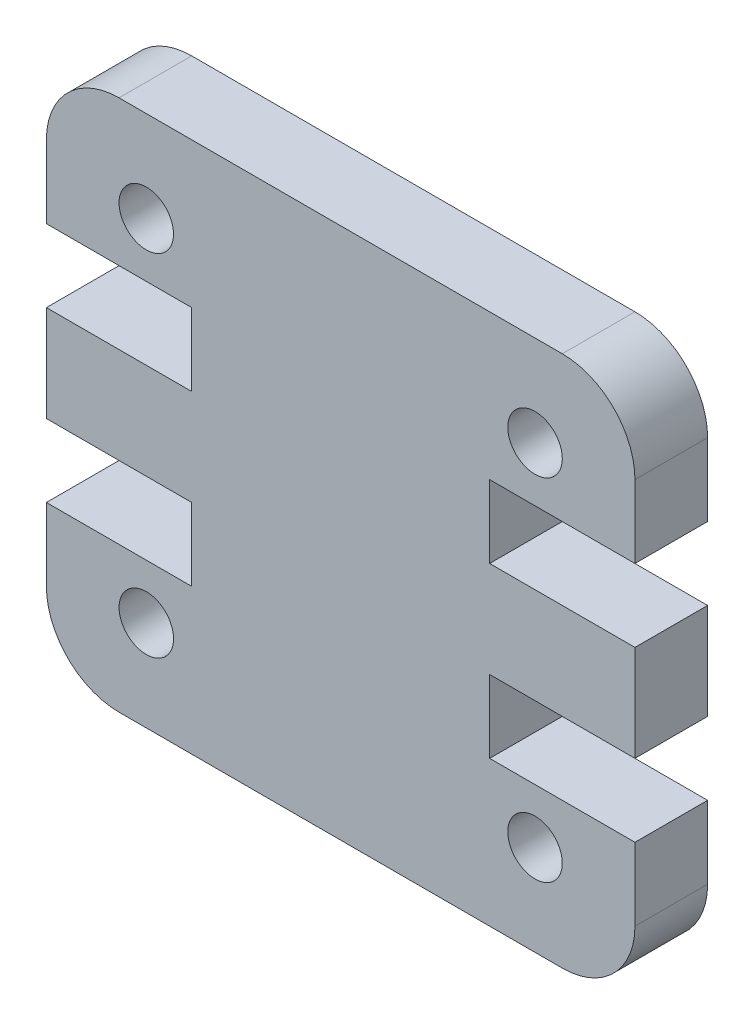
ISO-10303-21;
HEADER;
FILE_DESCRIPTION(('STEP AP214'),'2;1');
FILE_NAME('part.step','',(''),(''),'','','');
FILE_SCHEMA(('AUTOMOTIVE_DESIGN { 1 0 10303 214 1 1 1 1 }'));
ENDSEC;
DATA;
#1=APPLICATION_CONTEXT('core data for automotive mechanical design processes');
#2=APPLICATION_PROTOCOL_DEFINITION('international standard','automotive_design',2000,#1);
#3=PRODUCT_CONTEXT('',#1,'mechanical');
#4=PRODUCT('Part','Part','',(#3));
#5=PRODUCT_RELATED_PRODUCT_CATEGORY('part','',(#4));
#6=PRODUCT_DEFINITION_FORMATION('','',#4);
#7=PRODUCT_DEFINITION_CONTEXT('part definition',#1,'design');
#8=PRODUCT_DEFINITION('design','',#6,#7);
#9=PRODUCT_DEFINITION_SHAPE('','',#8);
#10=(LENGTH_UNIT() NAMED_UNIT(*) SI_UNIT(.MILLI.,.METRE.));
#11=(NAMED_UNIT(*) PLANE_ANGLE_UNIT() SI_UNIT($,.RADIAN.));
#12=(NAMED_UNIT(*) SI_UNIT($,.STERADIAN.) SOLID_ANGLE_UNIT());
#13=UNCERTAINTY_MEASURE_WITH_UNIT(LENGTH_MEASURE(1.E-05),#10,'distance_accuracy_value','');
#14=(GEOMETRIC_REPRESENTATION_CONTEXT(3) GLOBAL_UNCERTAINTY_ASSIGNED_CONTEXT((#13)) GLOBAL_UNIT_ASSIGNED_CONTEXT((#10,
#11,#12)) REPRESENTATION_CONTEXT('',''));
#15=CARTESIAN_POINT('',(0.,0.,0.));
#16=DIRECTION('',(0.,0.,1.));
#17=DIRECTION('',(1.,0.,0.));
#18=AXIS2_PLACEMENT_3D('',#15,#16,#17);
#19=CARTESIAN_POINT('',(14.2,2.,2.));
#20=DIRECTION('',(0.,0.,-1.));
#21=DIRECTION('',(-1.,0.,0.));
#22=AXIS2_PLACEMENT_3D('',#19,#20,#21);
#23=PLANE('',#22);
#24=CARTESIAN_POINT('',(13.4499999999986,12.1450000000001,2.));
#25=DIRECTION('',(0.,0.,1.));
#26=DIRECTION('',(1.,0.,0.));
#27=AXIS2_PLACEMENT_3D('',#24,#25,#26);
#28=CIRCLE('',#27,0.750000000000002);
#29=CARTESIAN_POINT('',(14.1999999999986,12.1450000000001,2.));
#30=VERTEX_POINT('',#29);
#31=EDGE_CURVE('E448',#30,#30,#28,.T.);
#32=ORIENTED_EDGE('',*,*,#31,.F.);
#33=EDGE_LOOP('',(#32));
#34=FACE_BOUND('',#33,.T.);
#35=CARTESIAN_POINT('',(13.4499999999986,2.4999999999999,2.));
#36=DIRECTION('',(0.,0.,1.));
#37=DIRECTION('',(-1.,0.,0.));
#38=AXIS2_PLACEMENT_3D('',#35,#36,#37);
#39=CIRCLE('',#38,0.750000000000002);
#40=CARTESIAN_POINT('',(12.6999999999986,2.4999999999999,2.));
#41=VERTEX_POINT('',#40);
#42=EDGE_CURVE('E230',#41,#41,#39,.T.);
#43=ORIENTED_EDGE('',*,*,#42,.F.);
#44=EDGE_LOOP('',(#43));
#45=FACE_BOUND('',#44,.T.);
#46=CARTESIAN_POINT('',(14.2,2.,2.));
#47=DIRECTION('',(0.,0.,1.));
#48=DIRECTION('',(-1.,0.,0.));
#49=AXIS2_PLACEMENT_3D('',#46,#47,#48);
#50=CIRCLE('',#49,2.);
#51=CARTESIAN_POINT('',(14.2,0.,2.));
#52=VERTEX_POINT('',#51);
#53=CARTESIAN_POINT('',(16.2,2.,2.));
#54=VERTEX_POINT('',#53);
#55=EDGE_CURVE('E273',#52,#54,#50,.T.);
#56=ORIENTED_EDGE('',*,*,#55,.T.);
#57=DIRECTION('',(0.,1.,0.));
#58=VECTOR('',#57,1.);
#59=CARTESIAN_POINT('',(16.2,4.,2.));
#60=LINE('',#59,#58);
#61=CARTESIAN_POINT('',(16.2,4.,2.));
#62=VERTEX_POINT('',#61);
#63=EDGE_CURVE('E141',#54,#62,#60,.T.);
#64=ORIENTED_EDGE('',*,*,#63,.T.);
#65=DIRECTION('',(-1.,0.,0.));
#66=VECTOR('',#65,1.);
#67=CARTESIAN_POINT('',(12.2,4.,2.));
#68=LINE('',#67,#66);
#69=CARTESIAN_POINT('',(12.2,4.,2.));
#70=VERTEX_POINT('',#69);
#71=EDGE_CURVE('E336',#62,#70,#68,.T.);
#72=ORIENTED_EDGE('',*,*,#71,.T.);
#73=DIRECTION('',(0.,1.,0.));
#74=VECTOR('',#73,1.);
#75=CARTESIAN_POINT('',(12.2,6.,2.));
#76=LINE('',#75,#74);
#77=CARTESIAN_POINT('',(12.2,6.,2.));
#78=VERTEX_POINT('',#77);
#79=EDGE_CURVE('E355',#70,#78,#76,.T.);
#80=ORIENTED_EDGE('',*,*,#79,.T.);
#81=DIRECTION('',(1.,0.,0.));
#82=VECTOR('',#81,1.);
#83=CARTESIAN_POINT('',(16.2,6.,2.));
#84=LINE('',#83,#82);
#85=CARTESIAN_POINT('',(16.2,6.,2.));
#86=VERTEX_POINT('',#85);
#87=EDGE_CURVE('E352',#78,#86,#84,.T.);
#88=ORIENTED_EDGE('',*,*,#87,.T.);
#89=DIRECTION('',(0.,1.,0.));
#90=VECTOR('',#89,1.);
#91=CARTESIAN_POINT('',(16.2,8.645,2.));
#92=LINE('',#91,#90);
#93=CARTESIAN_POINT('',(16.2,8.645,2.));
#94=VERTEX_POINT('',#93);
#95=EDGE_CURVE('E354',#86,#94,#92,.T.);
#96=ORIENTED_EDGE('',*,*,#95,.T.);
#97=DIRECTION('',(-1.,0.,0.));
#98=VECTOR('',#97,1.);
#99=CARTESIAN_POINT('',(16.2,8.645,2.));
#100=LINE('',#99,#98);
#101=CARTESIAN_POINT('',(12.2,8.645,2.));
#102=VERTEX_POINT('',#101);
#103=EDGE_CURVE('E357',#94,#102,#100,.T.);
#104=ORIENTED_EDGE('',*,*,#103,.T.);
#105=DIRECTION('',(0.,1.,0.));
#106=VECTOR('',#105,1.);
#107=CARTESIAN_POINT('',(12.2,8.645,2.));
#108=LINE('',#107,#106);
#109=CARTESIAN_POINT('',(12.2,10.645,2.));
#110=VERTEX_POINT('',#109);
#111=EDGE_CURVE('E363',#102,#110,#108,.T.);
#112=ORIENTED_EDGE('',*,*,#111,.T.);
#113=DIRECTION('',(1.,0.,0.));
#114=VECTOR('',#113,1.);
#115=CARTESIAN_POINT('',(12.2,10.645,2.));
#116=LINE('',#115,#114);
#117=CARTESIAN_POINT('',(16.2,10.645,2.));
#118=VERTEX_POINT('',#117);
#119=EDGE_CURVE('E365',#110,#118,#116,.T.);
#120=ORIENTED_EDGE('',*,*,#119,.T.);
#121=DIRECTION('',(0.,1.,0.));
#122=VECTOR('',#121,1.);
#123=CARTESIAN_POINT('',(16.2,10.645,2.));
#124=LINE('',#123,#122);
#125=CARTESIAN_POINT('',(16.2,12.645,2.));
#126=VERTEX_POINT('',#125);
#127=EDGE_CURVE('E367',#118,#126,#124,.T.);
#128=ORIENTED_EDGE('',*,*,#127,.T.);
#129=CARTESIAN_POINT('',(14.2,12.645,2.));
#130=DIRECTION('',(0.,0.,1.));
#131=DIRECTION('',(1.,0.,0.));
#132=AXIS2_PLACEMENT_3D('',#129,#130,#131);
#133=CIRCLE('',#132,2.);
#134=CARTESIAN_POINT('',(14.2,14.645,2.));
#135=VERTEX_POINT('',#134);
#136=EDGE_CURVE('E369',#126,#135,#133,.T.);
#137=ORIENTED_EDGE('',*,*,#136,.T.);
#138=DIRECTION('',(-1.,0.,0.));
#139=VECTOR('',#138,1.);
#140=CARTESIAN_POINT('',(2.,14.645,2.));
#141=LINE('',#140,#139);
#142=CARTESIAN_POINT('',(2.,14.645,2.));
#143=VERTEX_POINT('',#142);
#144=EDGE_CURVE('E371',#135,#143,#141,.T.);
#145=ORIENTED_EDGE('',*,*,#144,.T.);
#146=CARTESIAN_POINT('',(2.,12.645,2.));
#147=DIRECTION('',(0.,0.,1.));
#148=DIRECTION('',(-1.,0.,0.));
#149=AXIS2_PLACEMENT_3D('',#146,#147,#148);
#150=CIRCLE('',#149,2.);
#151=CARTESIAN_POINT('',(0.,12.645,2.));
#152=VERTEX_POINT('',#151);
#153=EDGE_CURVE('E373',#143,#152,#150,.T.);
#154=ORIENTED_EDGE('',*,*,#153,.T.);
#155=DIRECTION('',(0.,-1.,0.));
#156=VECTOR('',#155,1.);
#157=CARTESIAN_POINT('',(0.,10.645,2.));
#158=LINE('',#157,#156);
#159=CARTESIAN_POINT('',(0.,10.645,2.));
#160=VERTEX_POINT('',#159);
#161=EDGE_CURVE('E375',#152,#160,#158,.T.);
#162=ORIENTED_EDGE('',*,*,#161,.T.);
#163=DIRECTION('',(1.,0.,0.));
#164=VECTOR('',#163,1.);
#165=CARTESIAN_POINT('',(4.,10.645,2.));
#166=LINE('',#165,#164);
#167=CARTESIAN_POINT('',(4.,10.645,2.));
#168=VERTEX_POINT('',#167);
#169=EDGE_CURVE('E377',#160,#168,#166,.T.);
#170=ORIENTED_EDGE('',*,*,#169,.T.);
#171=DIRECTION('',(0.,-1.,0.));
#172=VECTOR('',#171,1.);
#173=CARTESIAN_POINT('',(4.,8.645,2.));
#174=LINE('',#173,#172);
#175=CARTESIAN_POINT('',(4.,8.645,2.));
#176=VERTEX_POINT('',#175);
#177=EDGE_CURVE('E379',#168,#176,#174,.T.);
#178=ORIENTED_EDGE('',*,*,#177,.T.);
#179=DIRECTION('',(-1.,0.,0.));
#180=VECTOR('',#179,1.);
#181=CARTESIAN_POINT('',(0.,8.645,2.));
#182=LINE('',#181,#180);
#183=CARTESIAN_POINT('',(0.,8.645,2.));
#184=VERTEX_POINT('',#183);
#185=EDGE_CURVE('E381',#176,#184,#182,.T.);
#186=ORIENTED_EDGE('',*,*,#185,.T.);
#187=DIRECTION('',(0.,-1.,0.));
#188=VECTOR('',#187,1.);
#189=CARTESIAN_POINT('',(0.,8.645,2.));
#190=LINE('',#189,#188);
#191=CARTESIAN_POINT('',(0.,6.00000000000003,2.));
#192=VERTEX_POINT('',#191);
#193=EDGE_CURVE('E383',#184,#192,#190,.T.);
#194=ORIENTED_EDGE('',*,*,#193,.T.);
#195=DIRECTION('',(1.,0.,0.));
#196=VECTOR('',#195,1.);
#197=CARTESIAN_POINT('',(0.,6.00000000000003,2.));
#198=LINE('',#197,#196);
#199=CARTESIAN_POINT('',(4.00000000000003,6.00000000000003,2.));
#200=VERTEX_POINT('',#199);
#201=EDGE_CURVE('E385',#192,#200,#198,.T.);
#202=ORIENTED_EDGE('',*,*,#201,.T.);
#203=DIRECTION('',(0.,-1.,0.));
#204=VECTOR('',#203,1.);
#205=CARTESIAN_POINT('',(4.00000000000003,6.00000000000003,2.));
#206=LINE('',#205,#204);
#207=CARTESIAN_POINT('',(4.00000000000003,4.00000000000002,2.));
#208=VERTEX_POINT('',#207);
#209=EDGE_CURVE('E387',#200,#208,#206,.T.);
#210=ORIENTED_EDGE('',*,*,#209,.T.);
#211=DIRECTION('',(-1.,0.,0.));
#212=VECTOR('',#211,1.);
#213=CARTESIAN_POINT('',(4.00000000000003,4.00000000000002,2.));
#214=LINE('',#213,#212);
#215=CARTESIAN_POINT('',(0.,4.00000000000003,2.));
#216=VERTEX_POINT('',#215);
#217=EDGE_CURVE('E208',#208,#216,#214,.T.);
#218=ORIENTED_EDGE('',*,*,#217,.T.);
#219=DIRECTION('',(0.,-1.,0.));
#220=VECTOR('',#219,1.);
#221=CARTESIAN_POINT('',(0.,4.00000000000003,2.));
#222=LINE('',#221,#220);
#223=CARTESIAN_POINT('',(0.,2.00000000000003,2.));
#224=VERTEX_POINT('',#223);
#225=EDGE_CURVE('E202',#216,#224,#222,.T.);
#226=ORIENTED_EDGE('',*,*,#225,.T.);
#227=CARTESIAN_POINT('',(2.,2.,2.));
#228=DIRECTION('',(0.,0.,1.));
#229=DIRECTION('',(1.,0.,0.));
#230=AXIS2_PLACEMENT_3D('',#227,#228,#229);
#231=CIRCLE('',#230,2.);
#232=CARTESIAN_POINT('',(2.,0.,2.));
#233=VERTEX_POINT('',#232);
#234=EDGE_CURVE('E206',#224,#233,#231,.T.);
#235=ORIENTED_EDGE('',*,*,#234,.T.);
#236=DIRECTION('',(1.,0.,0.));
#237=VECTOR('',#236,1.);
#238=CARTESIAN_POINT('',(2.,0.,2.));
#239=LINE('',#238,#237);
#240=EDGE_CURVE('E50',#233,#52,#239,.T.);
#241=ORIENTED_EDGE('',*,*,#240,.T.);
#242=EDGE_LOOP('',(#56,#64,#72,#80,#88,#96,#104,#112,#120,#128,#137,#145,#154,#162,#170,#178,
#186,#194,#202,#210,#218,#226,#235,#241));
#243=FACE_BOUND('',#242,.T.);
#244=CARTESIAN_POINT('',(2.75000000000139,12.1450000000001,2.));
#245=DIRECTION('',(0.,0.,1.));
#246=DIRECTION('',(-1.,0.,0.));
#247=AXIS2_PLACEMENT_3D('',#244,#245,#246);
#248=CIRCLE('',#247,0.750000000000001);
#249=CARTESIAN_POINT('',(2.00000000000139,12.1450000000001,2.));
#250=VERTEX_POINT('',#249);
#251=EDGE_CURVE('E454',#250,#250,#248,.T.);
#252=ORIENTED_EDGE('',*,*,#251,.F.);
#253=EDGE_LOOP('',(#252));
#254=FACE_BOUND('',#253,.T.);
#255=CARTESIAN_POINT('',(2.75000000000139,2.4999999999999,2.));
#256=DIRECTION('',(0.,0.,1.));
#257=DIRECTION('',(1.,0.,0.));
#258=AXIS2_PLACEMENT_3D('',#255,#256,#257);
#259=CIRCLE('',#258,0.75);
#260=CARTESIAN_POINT('',(3.50000000000139,2.4999999999999,2.));
#261=VERTEX_POINT('',#260);
#262=EDGE_CURVE('E439',#261,#261,#259,.T.);
#263=ORIENTED_EDGE('',*,*,#262,.F.);
#264=EDGE_LOOP('',(#263));
#265=FACE_BOUND('',#264,.T.);
#266=ADVANCED_FACE('F33',(#34,#45,#243,#254,#265),#23,.F.);
#267=CARTESIAN_POINT('',(14.2,2.,0.));
#268=DIRECTION('',(0.,0.,-1.));
#269=DIRECTION('',(-1.,0.,0.));
#270=AXIS2_PLACEMENT_3D('',#267,#268,#269);
#271=PLANE('',#270);
#272=CARTESIAN_POINT('',(13.4499999999986,12.1450000000001,0.));
#273=DIRECTION('',(0.,0.,1.));
#274=DIRECTION('',(1.,0.,0.));
#275=AXIS2_PLACEMENT_3D('',#272,#273,#274);
#276=CIRCLE('',#275,0.750000000000002);
#277=CARTESIAN_POINT('',(14.1999999999986,12.1450000000001,0.));
#278=VERTEX_POINT('',#277);
#279=EDGE_CURVE('E445',#278,#278,#276,.T.);
#280=ORIENTED_EDGE('',*,*,#279,.T.);
#281=EDGE_LOOP('',(#280));
#282=FACE_BOUND('',#281,.T.);
#283=CARTESIAN_POINT('',(13.4499999999986,2.4999999999999,0.));
#284=DIRECTION('',(0.,0.,1.));
#285=DIRECTION('',(-1.,0.,0.));
#286=AXIS2_PLACEMENT_3D('',#283,#284,#285);
#287=CIRCLE('',#286,0.750000000000002);
#288=CARTESIAN_POINT('',(12.6999999999986,2.4999999999999,0.));
#289=VERTEX_POINT('',#288);
#290=EDGE_CURVE('E457',#289,#289,#287,.T.);
#291=ORIENTED_EDGE('',*,*,#290,.T.);
#292=EDGE_LOOP('',(#291));
#293=FACE_BOUND('',#292,.T.);
#294=CARTESIAN_POINT('',(14.2,2.,0.));
#295=DIRECTION('',(0.,0.,1.));
#296=DIRECTION('',(-1.,0.,0.));
#297=AXIS2_PLACEMENT_3D('',#294,#295,#296);
#298=CIRCLE('',#297,2.);
#299=CARTESIAN_POINT('',(14.2,0.,0.));
#300=VERTEX_POINT('',#299);
#301=CARTESIAN_POINT('',(16.2,2.,0.));
#302=VERTEX_POINT('',#301);
#303=EDGE_CURVE('E226',#300,#302,#298,.T.);
#304=ORIENTED_EDGE('',*,*,#303,.F.);
#305=DIRECTION('',(1.,0.,0.));
#306=VECTOR('',#305,1.);
#307=CARTESIAN_POINT('',(2.,0.,0.));
#308=LINE('',#307,#306);
#309=CARTESIAN_POINT('',(2.,0.,0.));
#310=VERTEX_POINT('',#309);
#311=EDGE_CURVE('E133',#310,#300,#308,.T.);
#312=ORIENTED_EDGE('',*,*,#311,.F.);
#313=CARTESIAN_POINT('',(2.,2.,0.));
#314=DIRECTION('',(0.,0.,1.));
#315=DIRECTION('',(1.,0.,0.));
#316=AXIS2_PLACEMENT_3D('',#313,#314,#315);
#317=CIRCLE('',#316,2.);
#318=CARTESIAN_POINT('',(0.,2.00000000000003,0.));
#319=VERTEX_POINT('',#318);
#320=EDGE_CURVE('E127',#319,#310,#317,.T.);
#321=ORIENTED_EDGE('',*,*,#320,.F.);
#322=DIRECTION('',(0.,-1.,0.));
#323=VECTOR('',#322,1.);
#324=CARTESIAN_POINT('',(0.,4.00000000000003,0.));
#325=LINE('',#324,#323);
#326=CARTESIAN_POINT('',(0.,4.00000000000003,0.));
#327=VERTEX_POINT('',#326);
#328=EDGE_CURVE('E216',#327,#319,#325,.T.);
#329=ORIENTED_EDGE('',*,*,#328,.F.);
#330=DIRECTION('',(-1.,0.,0.));
#331=VECTOR('',#330,1.);
#332=CARTESIAN_POINT('',(4.00000000000003,4.00000000000002,0.));
#333=LINE('',#332,#331);
#334=CARTESIAN_POINT('',(4.00000000000003,4.00000000000002,0.));
#335=VERTEX_POINT('',#334);
#336=EDGE_CURVE('E268',#335,#327,#333,.T.);
#337=ORIENTED_EDGE('',*,*,#336,.F.);
#338=DIRECTION('',(0.,-1.,0.));
#339=VECTOR('',#338,1.);
#340=CARTESIAN_POINT('',(4.00000000000003,6.00000000000003,0.));
#341=LINE('',#340,#339);
#342=CARTESIAN_POINT('',(4.00000000000003,6.00000000000003,0.));
#343=VERTEX_POINT('',#342);
#344=EDGE_CURVE('E266',#343,#335,#341,.T.);
#345=ORIENTED_EDGE('',*,*,#344,.F.);
#346=DIRECTION('',(1.,0.,0.));
#347=VECTOR('',#346,1.);
#348=CARTESIAN_POINT('',(0.,6.00000000000003,0.));
#349=LINE('',#348,#347);
#350=CARTESIAN_POINT('',(0.,6.00000000000003,0.));
#351=VERTEX_POINT('',#350);
#352=EDGE_CURVE('E264',#351,#343,#349,.T.);
#353=ORIENTED_EDGE('',*,*,#352,.F.);
#354=DIRECTION('',(0.,-1.,0.));
#355=VECTOR('',#354,1.);
#356=CARTESIAN_POINT('',(0.,8.645,0.));
#357=LINE('',#356,#355);
#358=CARTESIAN_POINT('',(0.,8.645,0.));
#359=VERTEX_POINT('',#358);
#360=EDGE_CURVE('E262',#359,#351,#357,.T.);
#361=ORIENTED_EDGE('',*,*,#360,.F.);
#362=DIRECTION('',(-1.,0.,0.));
#363=VECTOR('',#362,1.);
#364=CARTESIAN_POINT('',(0.,8.645,0.));
#365=LINE('',#364,#363);
#366=CARTESIAN_POINT('',(4.,8.645,0.));
#367=VERTEX_POINT('',#366);
#368=EDGE_CURVE('E260',#367,#359,#365,.T.);
#369=ORIENTED_EDGE('',*,*,#368,.F.);
#370=DIRECTION('',(0.,-1.,0.));
#371=VECTOR('',#370,1.);
#372=CARTESIAN_POINT('',(4.,8.645,0.));
#373=LINE('',#372,#371);
#374=CARTESIAN_POINT('',(4.,10.645,0.));
#375=VERTEX_POINT('',#374);
#376=EDGE_CURVE('E258',#375,#367,#373,.T.);
#377=ORIENTED_EDGE('',*,*,#376,.F.);
#378=DIRECTION('',(1.,0.,0.));
#379=VECTOR('',#378,1.);
#380=CARTESIAN_POINT('',(4.,10.645,0.));
#381=LINE('',#380,#379);
#382=CARTESIAN_POINT('',(0.,10.645,0.));
#383=VERTEX_POINT('',#382);
#384=EDGE_CURVE('E256',#383,#375,#381,.T.);
#385=ORIENTED_EDGE('',*,*,#384,.F.);
#386=DIRECTION('',(0.,-1.,0.));
#387=VECTOR('',#386,1.);
#388=CARTESIAN_POINT('',(0.,10.645,0.));
#389=LINE('',#388,#387);
#390=CARTESIAN_POINT('',(0.,12.645,0.));
#391=VERTEX_POINT('',#390);
#392=EDGE_CURVE('E254',#391,#383,#389,.T.);
#393=ORIENTED_EDGE('',*,*,#392,.F.);
#394=CARTESIAN_POINT('',(2.,12.645,0.));
#395=DIRECTION('',(0.,0.,1.));
#396=DIRECTION('',(-1.,0.,0.));
#397=AXIS2_PLACEMENT_3D('',#394,#395,#396);
#398=CIRCLE('',#397,2.);
#399=CARTESIAN_POINT('',(2.,14.645,0.));
#400=VERTEX_POINT('',#399);
#401=EDGE_CURVE('E252',#400,#391,#398,.T.);
#402=ORIENTED_EDGE('',*,*,#401,.F.);
#403=DIRECTION('',(-1.,0.,0.));
#404=VECTOR('',#403,1.);
#405=CARTESIAN_POINT('',(2.,14.645,0.));
#406=LINE('',#405,#404);
#407=CARTESIAN_POINT('',(14.2,14.645,0.));
#408=VERTEX_POINT('',#407);
#409=EDGE_CURVE('E250',#408,#400,#406,.T.);
#410=ORIENTED_EDGE('',*,*,#409,.F.);
#411=CARTESIAN_POINT('',(14.2,12.645,0.));
#412=DIRECTION('',(0.,0.,1.));
#413=DIRECTION('',(1.,0.,0.));
#414=AXIS2_PLACEMENT_3D('',#411,#412,#413);
#415=CIRCLE('',#414,2.);
#416=CARTESIAN_POINT('',(16.2,12.645,0.));
#417=VERTEX_POINT('',#416);
#418=EDGE_CURVE('E248',#417,#408,#415,.T.);
#419=ORIENTED_EDGE('',*,*,#418,.F.);
#420=DIRECTION('',(0.,1.,0.));
#421=VECTOR('',#420,1.);
#422=CARTESIAN_POINT('',(16.2,10.645,0.));
#423=LINE('',#422,#421);
#424=CARTESIAN_POINT('',(16.2,10.645,0.));
#425=VERTEX_POINT('',#424);
#426=EDGE_CURVE('E246',#425,#417,#423,.T.);
#427=ORIENTED_EDGE('',*,*,#426,.F.);
#428=DIRECTION('',(1.,0.,0.));
#429=VECTOR('',#428,1.);
#430=CARTESIAN_POINT('',(12.2,10.645,0.));
#431=LINE('',#430,#429);
#432=CARTESIAN_POINT('',(12.2,10.645,0.));
#433=VERTEX_POINT('',#432);
#434=EDGE_CURVE('E244',#433,#425,#431,.T.);
#435=ORIENTED_EDGE('',*,*,#434,.F.);
#436=DIRECTION('',(0.,1.,0.));
#437=VECTOR('',#436,1.);
#438=CARTESIAN_POINT('',(12.2,8.645,0.));
#439=LINE('',#438,#437);
#440=CARTESIAN_POINT('',(12.2,8.645,0.));
#441=VERTEX_POINT('',#440);
#442=EDGE_CURVE('E242',#441,#433,#439,.T.);
#443=ORIENTED_EDGE('',*,*,#442,.F.);
#444=DIRECTION('',(-1.,0.,0.));
#445=VECTOR('',#444,1.);
#446=CARTESIAN_POINT('',(16.2,8.645,0.));
#447=LINE('',#446,#445);
#448=CARTESIAN_POINT('',(16.2,8.645,0.));
#449=VERTEX_POINT('',#448);
#450=EDGE_CURVE('E240',#449,#441,#447,.T.);
#451=ORIENTED_EDGE('',*,*,#450,.F.);
#452=DIRECTION('',(0.,1.,0.));
#453=VECTOR('',#452,1.);
#454=CARTESIAN_POINT('',(16.2,8.645,0.));
#455=LINE('',#454,#453);
#456=CARTESIAN_POINT('',(16.2,6.,0.));
#457=VERTEX_POINT('',#456);
#458=EDGE_CURVE('E238',#457,#449,#455,.T.);
#459=ORIENTED_EDGE('',*,*,#458,.F.);
#460=DIRECTION('',(1.,0.,0.));
#461=VECTOR('',#460,1.);
#462=CARTESIAN_POINT('',(16.2,6.,0.));
#463=LINE('',#462,#461);
#464=CARTESIAN_POINT('',(12.2,6.,0.));
#465=VERTEX_POINT('',#464);
#466=EDGE_CURVE('E236',#465,#457,#463,.T.);
#467=ORIENTED_EDGE('',*,*,#466,.F.);
#468=DIRECTION('',(0.,1.,0.));
#469=VECTOR('',#468,1.);
#470=CARTESIAN_POINT('',(12.2,6.,0.));
#471=LINE('',#470,#469);
#472=CARTESIAN_POINT('',(12.2,4.,0.));
#473=VERTEX_POINT('',#472);
#474=EDGE_CURVE('E234',#473,#465,#471,.T.);
#475=ORIENTED_EDGE('',*,*,#474,.F.);
#476=DIRECTION('',(-1.,0.,0.));
#477=VECTOR('',#476,1.);
#478=CARTESIAN_POINT('',(12.2,4.,0.));
#479=LINE('',#478,#477);
#480=CARTESIAN_POINT('',(16.2,4.,0.));
#481=VERTEX_POINT('',#480);
#482=EDGE_CURVE('E232',#481,#473,#479,.T.);
#483=ORIENTED_EDGE('',*,*,#482,.F.);
#484=DIRECTION('',(0.,1.,0.));
#485=VECTOR('',#484,1.);
#486=CARTESIAN_POINT('',(16.2,4.,0.));
#487=LINE('',#486,#485);
#488=EDGE_CURVE('E229',#302,#481,#487,.T.);
#489=ORIENTED_EDGE('',*,*,#488,.F.);
#490=EDGE_LOOP('',(#304,#312,#321,#329,#337,#345,#353,#361,#369,#377,#385,#393,#402,#410,#419,
#427,#435,#443,#451,#459,#467,#475,#483,#489));
#491=FACE_BOUND('',#490,.T.);
#492=CARTESIAN_POINT('',(2.75000000000139,12.1450000000001,0.));
#493=DIRECTION('',(0.,0.,1.));
#494=DIRECTION('',(-1.,0.,0.));
#495=AXIS2_PLACEMENT_3D('',#492,#493,#494);
#496=CIRCLE('',#495,0.750000000000001);
#497=CARTESIAN_POINT('',(2.00000000000139,12.1450000000001,0.));
#498=VERTEX_POINT('',#497);
#499=EDGE_CURVE('E451',#498,#498,#496,.T.);
#500=ORIENTED_EDGE('',*,*,#499,.T.);
#501=EDGE_LOOP('',(#500));
#502=FACE_BOUND('',#501,.T.);
#503=CARTESIAN_POINT('',(2.75000000000139,2.4999999999999,0.));
#504=DIRECTION('',(0.,0.,1.));
#505=DIRECTION('',(1.,0.,0.));
#506=AXIS2_PLACEMENT_3D('',#503,#504,#505);
#507=CIRCLE('',#506,0.75);
#508=CARTESIAN_POINT('',(3.50000000000139,2.4999999999999,0.));
#509=VERTEX_POINT('',#508);
#510=EDGE_CURVE('E442',#509,#509,#507,.T.);
#511=ORIENTED_EDGE('',*,*,#510,.T.);
#512=EDGE_LOOP('',(#511));
#513=FACE_BOUND('',#512,.T.);
#514=ADVANCED_FACE('F340',(#282,#293,#491,#502,#513),#271,.T.);
#515=CARTESIAN_POINT('',(14.2,2.,2.));
#516=DIRECTION('',(0.,0.,-1.));
#517=DIRECTION('',(-1.,0.,0.));
#518=AXIS2_PLACEMENT_3D('',#515,#516,#517);
#519=CYLINDRICAL_SURFACE('',#518,2.);
#520=ORIENTED_EDGE('',*,*,#303,.T.);
#521=DIRECTION('',(0.,0.,-1.));
#522=VECTOR('',#521,1.);
#523=CARTESIAN_POINT('',(16.2,2.,2.));
#524=LINE('',#523,#522);
#525=EDGE_CURVE('E11',#54,#302,#524,.T.);
#526=ORIENTED_EDGE('',*,*,#525,.F.);
#527=ORIENTED_EDGE('',*,*,#55,.F.);
#528=DIRECTION('',(0.,0.,-1.));
#529=VECTOR('',#528,1.);
#530=CARTESIAN_POINT('',(14.2,0.,2.));
#531=LINE('',#530,#529);
#532=EDGE_CURVE('E222',#52,#300,#531,.T.);
#533=ORIENTED_EDGE('',*,*,#532,.T.);
#534=EDGE_LOOP('',(#520,#526,#527,#533));
#535=FACE_BOUND('',#534,.T.);
#536=ADVANCED_FACE('F35',(#535),#519,.T.);
#537=CARTESIAN_POINT('',(16.2,4.,2.));
#538=DIRECTION('',(-1.,0.,0.));
#539=DIRECTION('',(0.,0.,1.));
#540=AXIS2_PLACEMENT_3D('',#537,#538,#539);
#541=PLANE('',#540);
#542=ORIENTED_EDGE('',*,*,#488,.T.);
#543=DIRECTION('',(0.,0.,-1.));
#544=VECTOR('',#543,1.);
#545=CARTESIAN_POINT('',(16.2,4.,2.));
#546=LINE('',#545,#544);
#547=EDGE_CURVE('E42',#62,#481,#546,.T.);
#548=ORIENTED_EDGE('',*,*,#547,.F.);
#549=ORIENTED_EDGE('',*,*,#63,.F.);
#550=ORIENTED_EDGE('',*,*,#525,.T.);
#551=EDGE_LOOP('',(#542,#548,#549,#550));
#552=FACE_BOUND('',#551,.T.);
#553=ADVANCED_FACE('F686',(#552),#541,.F.);
#554=CARTESIAN_POINT('',(12.2,4.,2.));
#555=DIRECTION('',(0.,-1.,0.));
#556=DIRECTION('',(0.,0.,-1.));
#557=AXIS2_PLACEMENT_3D('',#554,#555,#556);
#558=PLANE('',#557);
#559=ORIENTED_EDGE('',*,*,#482,.T.);
#560=DIRECTION('',(0.,0.,-1.));
#561=VECTOR('',#560,1.);
#562=CARTESIAN_POINT('',(12.2,4.,2.));
#563=LINE('',#562,#561);
#564=EDGE_CURVE('E328',#70,#473,#563,.T.);
#565=ORIENTED_EDGE('',*,*,#564,.F.);
#566=ORIENTED_EDGE('',*,*,#71,.F.);
#567=ORIENTED_EDGE('',*,*,#547,.T.);
#568=EDGE_LOOP('',(#559,#565,#566,#567));
#569=FACE_BOUND('',#568,.T.);
#570=ADVANCED_FACE('F334',(#569),#558,.F.);
#571=CARTESIAN_POINT('',(12.2,6.,2.));
#572=DIRECTION('',(-1.,0.,0.));
#573=DIRECTION('',(0.,0.,1.));
#574=AXIS2_PLACEMENT_3D('',#571,#572,#573);
#575=PLANE('',#574);
#576=ORIENTED_EDGE('',*,*,#474,.T.);
#577=DIRECTION('',(0.,0.,-1.));
#578=VECTOR('',#577,1.);
#579=CARTESIAN_POINT('',(12.2,6.,2.));
#580=LINE('',#579,#578);
#581=EDGE_CURVE('E325',#78,#465,#580,.T.);
#582=ORIENTED_EDGE('',*,*,#581,.F.);
#583=ORIENTED_EDGE('',*,*,#79,.F.);
#584=ORIENTED_EDGE('',*,*,#564,.T.);
#585=EDGE_LOOP('',(#576,#582,#583,#584));
#586=FACE_BOUND('',#585,.T.);
#587=ADVANCED_FACE('F346',(#586),#575,.F.);
#588=CARTESIAN_POINT('',(16.2,6.,2.));
#589=DIRECTION('',(0.,1.,0.));
#590=DIRECTION('',(0.,0.,1.));
#591=AXIS2_PLACEMENT_3D('',#588,#589,#590);
#592=PLANE('',#591);
#593=ORIENTED_EDGE('',*,*,#466,.T.);
#594=DIRECTION('',(0.,0.,-1.));
#595=VECTOR('',#594,1.);
#596=CARTESIAN_POINT('',(16.2,6.,2.));
#597=LINE('',#596,#595);
#598=EDGE_CURVE('E322',#86,#457,#597,.T.);
#599=ORIENTED_EDGE('',*,*,#598,.F.);
#600=ORIENTED_EDGE('',*,*,#87,.F.);
#601=ORIENTED_EDGE('',*,*,#581,.T.);
#602=EDGE_LOOP('',(#593,#599,#600,#601));
#603=FACE_BOUND('',#602,.T.);
#604=ADVANCED_FACE('F350',(#603),#592,.F.);
#605=CARTESIAN_POINT('',(16.2,8.645,2.));
#606=DIRECTION('',(-1.,0.,0.));
#607=DIRECTION('',(0.,0.,1.));
#608=AXIS2_PLACEMENT_3D('',#605,#606,#607);
#609=PLANE('',#608);
#610=ORIENTED_EDGE('',*,*,#458,.T.);
#611=DIRECTION('',(0.,0.,-1.));
#612=VECTOR('',#611,1.);
#613=CARTESIAN_POINT('',(16.2,8.645,2.));
#614=LINE('',#613,#612);
#615=EDGE_CURVE('E319',#94,#449,#614,.T.);
#616=ORIENTED_EDGE('',*,*,#615,.F.);
#617=ORIENTED_EDGE('',*,*,#95,.F.);
#618=ORIENTED_EDGE('',*,*,#598,.T.);
#619=EDGE_LOOP('',(#610,#616,#617,#618));
#620=FACE_BOUND('',#619,.T.);
#621=ADVANCED_FACE('F651',(#620),#609,.F.);
#622=CARTESIAN_POINT('',(16.2,8.645,2.));
#623=DIRECTION('',(0.,-1.,0.));
#624=DIRECTION('',(0.,0.,-1.));
#625=AXIS2_PLACEMENT_3D('',#622,#623,#624);
#626=PLANE('',#625);
#627=ORIENTED_EDGE('',*,*,#450,.T.);
#628=DIRECTION('',(0.,0.,-1.));
#629=VECTOR('',#628,1.);
#630=CARTESIAN_POINT('',(12.2,8.645,2.));
#631=LINE('',#630,#629);
#632=EDGE_CURVE('E316',#102,#441,#631,.T.);
#633=ORIENTED_EDGE('',*,*,#632,.F.);
#634=ORIENTED_EDGE('',*,*,#103,.F.);
#635=ORIENTED_EDGE('',*,*,#615,.T.);
#636=EDGE_LOOP('',(#627,#633,#634,#635));
#637=FACE_BOUND('',#636,.T.);
#638=ADVANCED_FACE('F641',(#637),#626,.F.);
#639=CARTESIAN_POINT('',(12.2,8.645,2.));
#640=DIRECTION('',(-1.,0.,0.));
#641=DIRECTION('',(0.,0.,1.));
#642=AXIS2_PLACEMENT_3D('',#639,#640,#641);
#643=PLANE('',#642);
#644=ORIENTED_EDGE('',*,*,#442,.T.);
#645=DIRECTION('',(0.,0.,-1.));
#646=VECTOR('',#645,1.);
#647=CARTESIAN_POINT('',(12.2,10.645,2.));
#648=LINE('',#647,#646);
#649=EDGE_CURVE('E313',#110,#433,#648,.T.);
#650=ORIENTED_EDGE('',*,*,#649,.F.);
#651=ORIENTED_EDGE('',*,*,#111,.F.);
#652=ORIENTED_EDGE('',*,*,#632,.T.);
#653=EDGE_LOOP('',(#644,#650,#651,#652));
#654=FACE_BOUND('',#653,.T.);
#655=ADVANCED_FACE('F631',(#654),#643,.F.);
#656=CARTESIAN_POINT('',(12.2,10.645,2.));
#657=DIRECTION('',(0.,1.,0.));
#658=DIRECTION('',(0.,0.,1.));
#659=AXIS2_PLACEMENT_3D('',#656,#657,#658);
#660=PLANE('',#659);
#661=ORIENTED_EDGE('',*,*,#434,.T.);
#662=DIRECTION('',(0.,0.,-1.));
#663=VECTOR('',#662,1.);
#664=CARTESIAN_POINT('',(16.2,10.645,2.));
#665=LINE('',#664,#663);
#666=EDGE_CURVE('E310',#118,#425,#665,.T.);
#667=ORIENTED_EDGE('',*,*,#666,.F.);
#668=ORIENTED_EDGE('',*,*,#119,.F.);
#669=ORIENTED_EDGE('',*,*,#649,.T.);
#670=EDGE_LOOP('',(#661,#667,#668,#669));
#671=FACE_BOUND('',#670,.T.);
#672=ADVANCED_FACE('F621',(#671),#660,.F.);
#673=CARTESIAN_POINT('',(16.2,10.645,2.));
#674=DIRECTION('',(-1.,0.,0.));
#675=DIRECTION('',(0.,0.,1.));
#676=AXIS2_PLACEMENT_3D('',#673,#674,#675);
#677=PLANE('',#676);
#678=ORIENTED_EDGE('',*,*,#426,.T.);
#679=DIRECTION('',(0.,0.,-1.));
#680=VECTOR('',#679,1.);
#681=CARTESIAN_POINT('',(16.2,12.645,2.));
#682=LINE('',#681,#680);
#683=EDGE_CURVE('E307',#126,#417,#682,.T.);
#684=ORIENTED_EDGE('',*,*,#683,.F.);
#685=ORIENTED_EDGE('',*,*,#127,.F.);
#686=ORIENTED_EDGE('',*,*,#666,.T.);
#687=EDGE_LOOP('',(#678,#684,#685,#686));
#688=FACE_BOUND('',#687,.T.);
#689=ADVANCED_FACE('F611',(#688),#677,.F.);
#690=CARTESIAN_POINT('',(14.2,12.645,2.));
#691=DIRECTION('',(0.,0.,-1.));
#692=DIRECTION('',(-1.,0.,0.));
#693=AXIS2_PLACEMENT_3D('',#690,#691,#692);
#694=CYLINDRICAL_SURFACE('',#693,2.);
#695=ORIENTED_EDGE('',*,*,#418,.T.);
#696=DIRECTION('',(0.,0.,-1.));
#697=VECTOR('',#696,1.);
#698=CARTESIAN_POINT('',(14.2,14.645,2.));
#699=LINE('',#698,#697);
#700=EDGE_CURVE('E304',#135,#408,#699,.T.);
#701=ORIENTED_EDGE('',*,*,#700,.F.);
#702=ORIENTED_EDGE('',*,*,#136,.F.);
#703=ORIENTED_EDGE('',*,*,#683,.T.);
#704=EDGE_LOOP('',(#695,#701,#702,#703));
#705=FACE_BOUND('',#704,.T.);
#706=ADVANCED_FACE('F601',(#705),#694,.T.);
#707=CARTESIAN_POINT('',(2.,14.645,2.));
#708=DIRECTION('',(0.,-1.,0.));
#709=DIRECTION('',(0.,0.,-1.));
#710=AXIS2_PLACEMENT_3D('',#707,#708,#709);
#711=PLANE('',#710);
#712=ORIENTED_EDGE('',*,*,#409,.T.);
#713=DIRECTION('',(0.,0.,-1.));
#714=VECTOR('',#713,1.);
#715=CARTESIAN_POINT('',(2.,14.645,2.));
#716=LINE('',#715,#714);
#717=EDGE_CURVE('E301',#143,#400,#716,.T.);
#718=ORIENTED_EDGE('',*,*,#717,.F.);
#719=ORIENTED_EDGE('',*,*,#144,.F.);
#720=ORIENTED_EDGE('',*,*,#700,.T.);
#721=EDGE_LOOP('',(#712,#718,#719,#720));
#722=FACE_BOUND('',#721,.T.);
#723=ADVANCED_FACE('F591',(#722),#711,.F.);
#724=CARTESIAN_POINT('',(2.,12.645,2.));
#725=DIRECTION('',(0.,0.,-1.));
#726=DIRECTION('',(-1.,0.,0.));
#727=AXIS2_PLACEMENT_3D('',#724,#725,#726);
#728=CYLINDRICAL_SURFACE('',#727,2.);
#729=ORIENTED_EDGE('',*,*,#401,.T.);
#730=DIRECTION('',(0.,0.,-1.));
#731=VECTOR('',#730,1.);
#732=CARTESIAN_POINT('',(0.,12.645,2.));
#733=LINE('',#732,#731);
#734=EDGE_CURVE('E298',#152,#391,#733,.T.);
#735=ORIENTED_EDGE('',*,*,#734,.F.);
#736=ORIENTED_EDGE('',*,*,#153,.F.);
#737=ORIENTED_EDGE('',*,*,#717,.T.);
#738=EDGE_LOOP('',(#729,#735,#736,#737));
#739=FACE_BOUND('',#738,.T.);
#740=ADVANCED_FACE('F581',(#739),#728,.T.);
#741=CARTESIAN_POINT('',(0.,10.645,2.));
#742=DIRECTION('',(1.,0.,0.));
#743=DIRECTION('',(0.,0.,-1.));
#744=AXIS2_PLACEMENT_3D('',#741,#742,#743);
#745=PLANE('',#744);
#746=ORIENTED_EDGE('',*,*,#392,.T.);
#747=DIRECTION('',(0.,0.,-1.));
#748=VECTOR('',#747,1.);
#749=CARTESIAN_POINT('',(0.,10.645,2.));
#750=LINE('',#749,#748);
#751=EDGE_CURVE('E295',#160,#383,#750,.T.);
#752=ORIENTED_EDGE('',*,*,#751,.F.);
#753=ORIENTED_EDGE('',*,*,#161,.F.);
#754=ORIENTED_EDGE('',*,*,#734,.T.);
#755=EDGE_LOOP('',(#746,#752,#753,#754));
#756=FACE_BOUND('',#755,.T.);
#757=ADVANCED_FACE('F571',(#756),#745,.F.);
#758=CARTESIAN_POINT('',(4.,10.645,2.));
#759=DIRECTION('',(0.,1.,0.));
#760=DIRECTION('',(0.,0.,1.));
#761=AXIS2_PLACEMENT_3D('',#758,#759,#760);
#762=PLANE('',#761);
#763=ORIENTED_EDGE('',*,*,#384,.T.);
#764=DIRECTION('',(0.,0.,-1.));
#765=VECTOR('',#764,1.);
#766=CARTESIAN_POINT('',(4.,10.645,2.));
#767=LINE('',#766,#765);
#768=EDGE_CURVE('E292',#168,#375,#767,.T.);
#769=ORIENTED_EDGE('',*,*,#768,.F.);
#770=ORIENTED_EDGE('',*,*,#169,.F.);
#771=ORIENTED_EDGE('',*,*,#751,.T.);
#772=EDGE_LOOP('',(#763,#769,#770,#771));
#773=FACE_BOUND('',#772,.T.);
#774=ADVANCED_FACE('F561',(#773),#762,.F.);
#775=CARTESIAN_POINT('',(4.,8.645,2.));
#776=DIRECTION('',(1.,0.,0.));
#777=DIRECTION('',(0.,0.,-1.));
#778=AXIS2_PLACEMENT_3D('',#775,#776,#777);
#779=PLANE('',#778);
#780=ORIENTED_EDGE('',*,*,#376,.T.);
#781=DIRECTION('',(0.,0.,-1.));
#782=VECTOR('',#781,1.);
#783=CARTESIAN_POINT('',(4.,8.645,2.));
#784=LINE('',#783,#782);
#785=EDGE_CURVE('E289',#176,#367,#784,.T.);
#786=ORIENTED_EDGE('',*,*,#785,.F.);
#787=ORIENTED_EDGE('',*,*,#177,.F.);
#788=ORIENTED_EDGE('',*,*,#768,.T.);
#789=EDGE_LOOP('',(#780,#786,#787,#788));
#790=FACE_BOUND('',#789,.T.);
#791=ADVANCED_FACE('F551',(#790),#779,.F.);
#792=CARTESIAN_POINT('',(0.,8.645,2.));
#793=DIRECTION('',(0.,-1.,0.));
#794=DIRECTION('',(0.,0.,-1.));
#795=AXIS2_PLACEMENT_3D('',#792,#793,#794);
#796=PLANE('',#795);
#797=ORIENTED_EDGE('',*,*,#368,.T.);
#798=DIRECTION('',(0.,0.,-1.));
#799=VECTOR('',#798,1.);
#800=CARTESIAN_POINT('',(0.,8.645,2.));
#801=LINE('',#800,#799);
#802=EDGE_CURVE('E286',#184,#359,#801,.T.);
#803=ORIENTED_EDGE('',*,*,#802,.F.);
#804=ORIENTED_EDGE('',*,*,#185,.F.);
#805=ORIENTED_EDGE('',*,*,#785,.T.);
#806=EDGE_LOOP('',(#797,#803,#804,#805));
#807=FACE_BOUND('',#806,.T.);
#808=ADVANCED_FACE('F541',(#807),#796,.F.);
#809=CARTESIAN_POINT('',(0.,8.645,2.));
#810=DIRECTION('',(1.,0.,0.));
#811=DIRECTION('',(0.,1.,0.));
#812=AXIS2_PLACEMENT_3D('',#809,#810,#811);
#813=PLANE('',#812);
#814=ORIENTED_EDGE('',*,*,#360,.T.);
#815=DIRECTION('',(0.,0.,-1.));
#816=VECTOR('',#815,1.);
#817=CARTESIAN_POINT('',(0.,6.00000000000003,2.));
#818=LINE('',#817,#816);
#819=EDGE_CURVE('E283',#192,#351,#818,.T.);
#820=ORIENTED_EDGE('',*,*,#819,.F.);
#821=ORIENTED_EDGE('',*,*,#193,.F.);
#822=ORIENTED_EDGE('',*,*,#802,.T.);
#823=EDGE_LOOP('',(#814,#820,#821,#822));
#824=FACE_BOUND('',#823,.T.);
#825=ADVANCED_FACE('F531',(#824),#813,.F.);
#826=CARTESIAN_POINT('',(0.,6.00000000000003,2.));
#827=DIRECTION('',(0.,1.,0.));
#828=DIRECTION('',(-1.,0.,0.));
#829=AXIS2_PLACEMENT_3D('',#826,#827,#828);
#830=PLANE('',#829);
#831=ORIENTED_EDGE('',*,*,#352,.T.);
#832=DIRECTION('',(0.,0.,-1.));
#833=VECTOR('',#832,1.);
#834=CARTESIAN_POINT('',(4.00000000000003,6.00000000000003,2.));
#835=LINE('',#834,#833);
#836=EDGE_CURVE('E280',#200,#343,#835,.T.);
#837=ORIENTED_EDGE('',*,*,#836,.F.);
#838=ORIENTED_EDGE('',*,*,#201,.F.);
#839=ORIENTED_EDGE('',*,*,#819,.T.);
#840=EDGE_LOOP('',(#831,#837,#838,#839));
#841=FACE_BOUND('',#840,.T.);
#842=ADVANCED_FACE('F522',(#841),#830,.F.);
#843=CARTESIAN_POINT('',(4.00000000000003,6.00000000000003,2.));
#844=DIRECTION('',(1.,0.,0.));
#845=DIRECTION('',(0.,0.,-1.));
#846=AXIS2_PLACEMENT_3D('',#843,#844,#845);
#847=PLANE('',#846);
#848=ORIENTED_EDGE('',*,*,#344,.T.);
#849=DIRECTION('',(0.,0.,-1.));
#850=VECTOR('',#849,1.);
#851=CARTESIAN_POINT('',(4.00000000000003,4.00000000000002,2.));
#852=LINE('',#851,#850);
#853=EDGE_CURVE('E277',#208,#335,#852,.T.);
#854=ORIENTED_EDGE('',*,*,#853,.F.);
#855=ORIENTED_EDGE('',*,*,#209,.F.);
#856=ORIENTED_EDGE('',*,*,#836,.T.);
#857=EDGE_LOOP('',(#848,#854,#855,#856));
#858=FACE_BOUND('',#857,.T.);
#859=ADVANCED_FACE('F393',(#858),#847,.F.);
#860=CARTESIAN_POINT('',(4.00000000000003,4.00000000000002,2.));
#861=DIRECTION('',(0.,-1.,0.));
#862=DIRECTION('',(1.,0.,0.));
#863=AXIS2_PLACEMENT_3D('',#860,#861,#862);
#864=PLANE('',#863);
#865=ORIENTED_EDGE('',*,*,#336,.T.);
#866=DIRECTION('',(0.,0.,-1.));
#867=VECTOR('',#866,1.);
#868=CARTESIAN_POINT('',(0.,4.00000000000003,2.));
#869=LINE('',#868,#867);
#870=EDGE_CURVE('E217',#216,#327,#869,.T.);
#871=ORIENTED_EDGE('',*,*,#870,.F.);
#872=ORIENTED_EDGE('',*,*,#217,.F.);
#873=ORIENTED_EDGE('',*,*,#853,.T.);
#874=EDGE_LOOP('',(#865,#871,#872,#873));
#875=FACE_BOUND('',#874,.T.);
#876=ADVANCED_FACE('F397',(#875),#864,.F.);
#877=CARTESIAN_POINT('',(0.,4.00000000000003,2.));
#878=DIRECTION('',(1.,0.,0.));
#879=DIRECTION('',(0.,1.,0.));
#880=AXIS2_PLACEMENT_3D('',#877,#878,#879);
#881=PLANE('',#880);
#882=ORIENTED_EDGE('',*,*,#328,.T.);
#883=DIRECTION('',(0.,0.,-1.));
#884=VECTOR('',#883,1.);
#885=CARTESIAN_POINT('',(0.,2.00000000000003,2.));
#886=LINE('',#885,#884);
#887=EDGE_CURVE('E213',#224,#319,#886,.T.);
#888=ORIENTED_EDGE('',*,*,#887,.F.);
#889=ORIENTED_EDGE('',*,*,#225,.F.);
#890=ORIENTED_EDGE('',*,*,#870,.T.);
#891=EDGE_LOOP('',(#882,#888,#889,#890));
#892=FACE_BOUND('',#891,.T.);
#893=ADVANCED_FACE('F214',(#892),#881,.F.);
#894=CARTESIAN_POINT('',(2.,2.,2.));
#895=DIRECTION('',(0.,0.,-1.));
#896=DIRECTION('',(-1.,0.,0.));
#897=AXIS2_PLACEMENT_3D('',#894,#895,#896);
#898=CYLINDRICAL_SURFACE('',#897,2.);
#899=ORIENTED_EDGE('',*,*,#320,.T.);
#900=DIRECTION('',(0.,0.,-1.));
#901=VECTOR('',#900,1.);
#902=CARTESIAN_POINT('',(2.,0.,2.));
#903=LINE('',#902,#901);
#904=EDGE_CURVE('E218',#233,#310,#903,.T.);
#905=ORIENTED_EDGE('',*,*,#904,.F.);
#906=ORIENTED_EDGE('',*,*,#234,.F.);
#907=ORIENTED_EDGE('',*,*,#887,.T.);
#908=EDGE_LOOP('',(#899,#905,#906,#907));
#909=FACE_BOUND('',#908,.T.);
#910=ADVANCED_FACE('F220',(#909),#898,.T.);
#911=CARTESIAN_POINT('',(2.,0.,2.));
#912=DIRECTION('',(0.,1.,0.));
#913=DIRECTION('',(0.,0.,1.));
#914=AXIS2_PLACEMENT_3D('',#911,#912,#913);
#915=PLANE('',#914);
#916=ORIENTED_EDGE('',*,*,#311,.T.);
#917=ORIENTED_EDGE('',*,*,#532,.F.);
#918=ORIENTED_EDGE('',*,*,#240,.F.);
#919=ORIENTED_EDGE('',*,*,#904,.T.);
#920=EDGE_LOOP('',(#916,#917,#918,#919));
#921=FACE_BOUND('',#920,.T.);
#922=ADVANCED_FACE('F401',(#921),#915,.F.);
#923=CARTESIAN_POINT('',(13.4499999999986,2.4999999999999,2.));
#924=DIRECTION('',(0.,0.,-1.));
#925=DIRECTION('',(-1.,0.,0.));
#926=AXIS2_PLACEMENT_3D('',#923,#924,#925);
#927=CYLINDRICAL_SURFACE('',#926,0.750000000000002);
#928=ORIENTED_EDGE('',*,*,#42,.T.);
#929=EDGE_LOOP('',(#928));
#930=FACE_BOUND('',#929,.T.);
#931=ORIENTED_EDGE('',*,*,#290,.F.);
#932=EDGE_LOOP('',(#931));
#933=FACE_BOUND('',#932,.T.);
#934=ADVANCED_FACE('F403',(#930,#933),#927,.F.);
#935=CARTESIAN_POINT('',(2.75000000000139,12.1450000000001,2.));
#936=DIRECTION('',(0.,0.,-1.));
#937=DIRECTION('',(-1.,0.,0.));
#938=AXIS2_PLACEMENT_3D('',#935,#936,#937);
#939=CYLINDRICAL_SURFACE('',#938,0.750000000000001);
#940=ORIENTED_EDGE('',*,*,#251,.T.);
#941=EDGE_LOOP('',(#940));
#942=FACE_BOUND('',#941,.T.);
#943=ORIENTED_EDGE('',*,*,#499,.F.);
#944=EDGE_LOOP('',(#943));
#945=FACE_BOUND('',#944,.T.);
#946=ADVANCED_FACE('F409',(#942,#945),#939,.F.);
#947=CARTESIAN_POINT('',(13.4499999999986,12.1450000000001,2.));
#948=DIRECTION('',(0.,0.,-1.));
#949=DIRECTION('',(-1.,0.,0.));
#950=AXIS2_PLACEMENT_3D('',#947,#948,#949);
#951=CYLINDRICAL_SURFACE('',#950,0.750000000000002);
#952=ORIENTED_EDGE('',*,*,#31,.T.);
#953=EDGE_LOOP('',(#952));
#954=FACE_BOUND('',#953,.T.);
#955=ORIENTED_EDGE('',*,*,#279,.F.);
#956=EDGE_LOOP('',(#955));
#957=FACE_BOUND('',#956,.T.);
#958=ADVANCED_FACE('F426',(#954,#957),#951,.F.);
#959=CARTESIAN_POINT('',(2.75000000000139,2.4999999999999,2.));
#960=DIRECTION('',(0.,0.,-1.));
#961=DIRECTION('',(-1.,0.,0.));
#962=AXIS2_PLACEMENT_3D('',#959,#960,#961);
#963=CYLINDRICAL_SURFACE('',#962,0.75);
#964=ORIENTED_EDGE('',*,*,#262,.T.);
#965=EDGE_LOOP('',(#964));
#966=FACE_BOUND('',#965,.T.);
#967=ORIENTED_EDGE('',*,*,#510,.F.);
#968=EDGE_LOOP('',(#967));
#969=FACE_BOUND('',#968,.T.);
#970=ADVANCED_FACE('F430',(#966,#969),#963,.F.);
#971=CLOSED_SHELL('',(#266,#514,#536,#553,#570,#587,#604,#621,#638,#655,#672,#689,#706,#723,
#740,#757,#774,#791,#808,#825,#842,#859,#876,#893,#910,#922,#934,#946,#958,#970));
#972=MANIFOLD_SOLID_BREP('B2',#971);
#973=ADVANCED_BREP_SHAPE_REPRESENTATION('',(#18,#972),#14);
#974=SHAPE_DEFINITION_REPRESENTATION(#9,#973);
ENDSEC;
END-ISO-10303-21;
